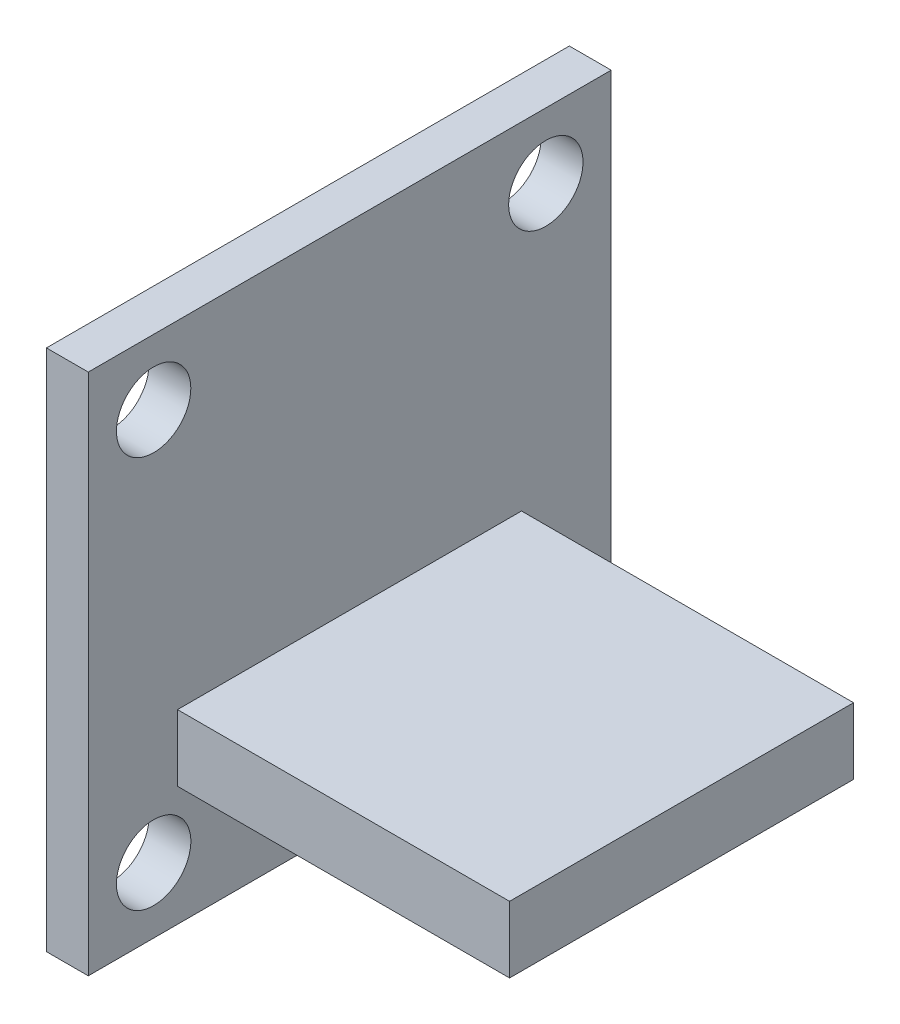
ISO-10303-21;
HEADER;
FILE_DESCRIPTION(('STEP AP214'),'2;1');
FILE_NAME('part.step','',(''),(''),'','','');
FILE_SCHEMA(('AUTOMOTIVE_DESIGN { 1 0 10303 214 1 1 1 1 }'));
ENDSEC;
DATA;
#1=APPLICATION_CONTEXT('core data for automotive mechanical design processes');
#2=APPLICATION_PROTOCOL_DEFINITION('international standard','automotive_design',2000,#1);
#3=PRODUCT_CONTEXT('',#1,'mechanical');
#4=PRODUCT('Part','Part','',(#3));
#5=PRODUCT_RELATED_PRODUCT_CATEGORY('part','',(#4));
#6=PRODUCT_DEFINITION_FORMATION('','',#4);
#7=PRODUCT_DEFINITION_CONTEXT('part definition',#1,'design');
#8=PRODUCT_DEFINITION('design','',#6,#7);
#9=PRODUCT_DEFINITION_SHAPE('','',#8);
#10=(LENGTH_UNIT() NAMED_UNIT(*) SI_UNIT(.MILLI.,.METRE.));
#11=(NAMED_UNIT(*) PLANE_ANGLE_UNIT() SI_UNIT($,.RADIAN.));
#12=(NAMED_UNIT(*) SI_UNIT($,.STERADIAN.) SOLID_ANGLE_UNIT());
#13=UNCERTAINTY_MEASURE_WITH_UNIT(LENGTH_MEASURE(1.E-05),#10,'distance_accuracy_value','');
#14=(GEOMETRIC_REPRESENTATION_CONTEXT(3) GLOBAL_UNCERTAINTY_ASSIGNED_CONTEXT((#13)) GLOBAL_UNIT_ASSIGNED_CONTEXT((#10,
#11,#12)) REPRESENTATION_CONTEXT('',''));
#15=CARTESIAN_POINT('',(0.,0.,0.));
#16=DIRECTION('',(0.,0.,1.));
#17=DIRECTION('',(1.,0.,0.));
#18=AXIS2_PLACEMENT_3D('',#15,#16,#17);
#19=CARTESIAN_POINT('',(1.6002,20.,0.));
#20=DIRECTION('',(-1.,0.,0.));
#21=DIRECTION('',(0.,0.,1.));
#22=AXIS2_PLACEMENT_3D('',#19,#20,#21);
#23=PLANE('',#22);
#24=DIRECTION('',(0.,-1.,0.));
#25=VECTOR('',#24,1.);
#26=CARTESIAN_POINT('',(1.6002,0.,0.));
#27=LINE('',#26,#25);
#28=CARTESIAN_POINT('',(1.6002,20.,0.));
#29=VERTEX_POINT('',#28);
#30=CARTESIAN_POINT('',(1.6002,0.,0.));
#31=VERTEX_POINT('',#30);
#32=EDGE_CURVE('E157',#29,#31,#27,.T.);
#33=ORIENTED_EDGE('',*,*,#32,.T.);
#34=DIRECTION('',(0.,0.,-1.));
#35=VECTOR('',#34,1.);
#36=CARTESIAN_POINT('',(1.6002,0.,0.));
#37=LINE('',#36,#35);
#38=CARTESIAN_POINT('',(1.6002,0.,-20.));
#39=VERTEX_POINT('',#38);
#40=EDGE_CURVE('E160',#31,#39,#37,.T.);
#41=ORIENTED_EDGE('',*,*,#40,.T.);
#42=DIRECTION('',(0.,1.,0.));
#43=VECTOR('',#42,1.);
#44=CARTESIAN_POINT('',(1.6002,0.,-20.));
#45=LINE('',#44,#43);
#46=CARTESIAN_POINT('',(1.6002,20.,-20.));
#47=VERTEX_POINT('',#46);
#48=EDGE_CURVE('E162',#39,#47,#45,.T.);
#49=ORIENTED_EDGE('',*,*,#48,.T.);
#50=DIRECTION('',(0.,0.,1.));
#51=VECTOR('',#50,1.);
#52=CARTESIAN_POINT('',(1.6002,20.,0.));
#53=LINE('',#52,#51);
#54=EDGE_CURVE('E164',#47,#29,#53,.T.);
#55=ORIENTED_EDGE('',*,*,#54,.T.);
#56=EDGE_LOOP('',(#33,#41,#49,#55));
#57=FACE_BOUND('',#56,.T.);
#58=CARTESIAN_POINT('',(1.6002,17.5,-2.5));
#59=DIRECTION('',(1.,0.,0.));
#60=DIRECTION('',(0.,0.,-1.));
#61=AXIS2_PLACEMENT_3D('',#58,#59,#60);
#62=CIRCLE('',#61,1.4224);
#63=CARTESIAN_POINT('',(1.6002,17.5,-3.9224));
#64=VERTEX_POINT('',#63);
#65=EDGE_CURVE('E142',#64,#64,#62,.T.);
#66=ORIENTED_EDGE('',*,*,#65,.F.);
#67=EDGE_LOOP('',(#66));
#68=FACE_BOUND('',#67,.T.);
#69=CARTESIAN_POINT('',(1.6002,17.5,-17.5));
#70=DIRECTION('',(1.,0.,0.));
#71=DIRECTION('',(0.,0.,1.));
#72=AXIS2_PLACEMENT_3D('',#69,#70,#71);
#73=CIRCLE('',#72,1.4224);
#74=CARTESIAN_POINT('',(1.6002,17.5,-16.0776));
#75=VERTEX_POINT('',#74);
#76=EDGE_CURVE('E136',#75,#75,#73,.T.);
#77=ORIENTED_EDGE('',*,*,#76,.F.);
#78=EDGE_LOOP('',(#77));
#79=FACE_BOUND('',#78,.T.);
#80=CARTESIAN_POINT('',(1.6002,2.5,-17.5));
#81=DIRECTION('',(1.,0.,0.));
#82=DIRECTION('',(0.,0.,-1.));
#83=AXIS2_PLACEMENT_3D('',#80,#81,#82);
#84=CIRCLE('',#83,1.4224);
#85=CARTESIAN_POINT('',(1.6002,2.5,-18.9224));
#86=VERTEX_POINT('',#85);
#87=EDGE_CURVE('E130',#86,#86,#84,.T.);
#88=ORIENTED_EDGE('',*,*,#87,.F.);
#89=EDGE_LOOP('',(#88));
#90=FACE_BOUND('',#89,.T.);
#91=CARTESIAN_POINT('',(1.6002,2.5,-2.5));
#92=DIRECTION('',(1.,0.,0.));
#93=DIRECTION('',(0.,0.,1.));
#94=AXIS2_PLACEMENT_3D('',#91,#92,#93);
#95=CIRCLE('',#94,1.4224);
#96=CARTESIAN_POINT('',(1.6002,2.5,-1.0776));
#97=VERTEX_POINT('',#96);
#98=EDGE_CURVE('E124',#97,#97,#95,.T.);
#99=ORIENTED_EDGE('',*,*,#98,.F.);
#100=EDGE_LOOP('',(#99));
#101=FACE_BOUND('',#100,.T.);
#102=DIRECTION('',(0.,-1.,0.));
#103=VECTOR('',#102,1.);
#104=CARTESIAN_POINT('',(1.6002,7.112,-3.4138));
#105=LINE('',#104,#103);
#106=CARTESIAN_POINT('',(1.6002,7.112,-3.4138));
#107=VERTEX_POINT('',#106);
#108=CARTESIAN_POINT('',(1.6002,4.572,-3.4138));
#109=VERTEX_POINT('',#108);
#110=EDGE_CURVE('E92',#107,#109,#105,.T.);
#111=ORIENTED_EDGE('',*,*,#110,.F.);
#112=DIRECTION('',(0.,0.,1.));
#113=VECTOR('',#112,1.);
#114=CARTESIAN_POINT('',(1.6002,7.112,-3.4138));
#115=LINE('',#114,#113);
#116=CARTESIAN_POINT('',(1.6002,7.112,-16.571));
#117=VERTEX_POINT('',#116);
#118=EDGE_CURVE('E94',#117,#107,#115,.T.);
#119=ORIENTED_EDGE('',*,*,#118,.F.);
#120=DIRECTION('',(0.,1.,0.));
#121=VECTOR('',#120,1.);
#122=CARTESIAN_POINT('',(1.6002,7.112,-16.571));
#123=LINE('',#122,#121);
#124=CARTESIAN_POINT('',(1.6002,4.572,-16.571));
#125=VERTEX_POINT('',#124);
#126=EDGE_CURVE('E51',#125,#117,#123,.T.);
#127=ORIENTED_EDGE('',*,*,#126,.F.);
#128=DIRECTION('',(0.,0.,-1.));
#129=VECTOR('',#128,1.);
#130=CARTESIAN_POINT('',(1.6002,4.572,-3.4138));
#131=LINE('',#130,#129);
#132=EDGE_CURVE('E46',#109,#125,#131,.T.);
#133=ORIENTED_EDGE('',*,*,#132,.F.);
#134=EDGE_LOOP('',(#111,#119,#127,#133));
#135=FACE_BOUND('',#134,.T.);
#136=ADVANCED_FACE('F31',(#57,#68,#79,#90,#101,#135),#23,.F.);
#137=CARTESIAN_POINT('',(1.6002,0.,0.));
#138=DIRECTION('',(0.,0.,-1.));
#139=DIRECTION('',(-1.,0.,0.));
#140=AXIS2_PLACEMENT_3D('',#137,#138,#139);
#141=PLANE('',#140);
#142=DIRECTION('',(0.,-1.,0.));
#143=VECTOR('',#142,1.);
#144=CARTESIAN_POINT('',(0.,0.,0.));
#145=LINE('',#144,#143);
#146=CARTESIAN_POINT('',(0.,20.,0.));
#147=VERTEX_POINT('',#146);
#148=CARTESIAN_POINT('',(0.,0.,0.));
#149=VERTEX_POINT('',#148);
#150=EDGE_CURVE('E148',#147,#149,#145,.T.);
#151=ORIENTED_EDGE('',*,*,#150,.T.);
#152=DIRECTION('',(-1.,0.,0.));
#153=VECTOR('',#152,1.);
#154=CARTESIAN_POINT('',(1.6002,0.,0.));
#155=LINE('',#154,#153);
#156=EDGE_CURVE('E11',#31,#149,#155,.T.);
#157=ORIENTED_EDGE('',*,*,#156,.F.);
#158=ORIENTED_EDGE('',*,*,#32,.F.);
#159=DIRECTION('',(-1.,0.,0.));
#160=VECTOR('',#159,1.);
#161=CARTESIAN_POINT('',(1.6002,20.,0.));
#162=LINE('',#161,#160);
#163=EDGE_CURVE('E166',#29,#147,#162,.T.);
#164=ORIENTED_EDGE('',*,*,#163,.T.);
#165=EDGE_LOOP('',(#151,#157,#158,#164));
#166=FACE_BOUND('',#165,.T.);
#167=ADVANCED_FACE('F33',(#166),#141,.F.);
#168=CARTESIAN_POINT('',(1.6002,0.,0.));
#169=DIRECTION('',(0.,1.,0.));
#170=DIRECTION('',(0.,0.,1.));
#171=AXIS2_PLACEMENT_3D('',#168,#169,#170);
#172=PLANE('',#171);
#173=DIRECTION('',(0.,0.,-1.));
#174=VECTOR('',#173,1.);
#175=CARTESIAN_POINT('',(0.,0.,0.));
#176=LINE('',#175,#174);
#177=CARTESIAN_POINT('',(0.,0.,-20.));
#178=VERTEX_POINT('',#177);
#179=EDGE_CURVE('E151',#149,#178,#176,.T.);
#180=ORIENTED_EDGE('',*,*,#179,.T.);
#181=DIRECTION('',(-1.,0.,0.));
#182=VECTOR('',#181,1.);
#183=CARTESIAN_POINT('',(1.6002,0.,-20.));
#184=LINE('',#183,#182);
#185=EDGE_CURVE('E39',#39,#178,#184,.T.);
#186=ORIENTED_EDGE('',*,*,#185,.F.);
#187=ORIENTED_EDGE('',*,*,#40,.F.);
#188=ORIENTED_EDGE('',*,*,#156,.T.);
#189=EDGE_LOOP('',(#180,#186,#187,#188));
#190=FACE_BOUND('',#189,.T.);
#191=ADVANCED_FACE('F192',(#190),#172,.F.);
#192=CARTESIAN_POINT('',(1.6002,0.,-20.));
#193=DIRECTION('',(0.,0.,1.));
#194=DIRECTION('',(1.,0.,0.));
#195=AXIS2_PLACEMENT_3D('',#192,#193,#194);
#196=PLANE('',#195);
#197=DIRECTION('',(0.,1.,0.));
#198=VECTOR('',#197,1.);
#199=CARTESIAN_POINT('',(0.,0.,-20.));
#200=LINE('',#199,#198);
#201=CARTESIAN_POINT('',(0.,20.,-20.));
#202=VERTEX_POINT('',#201);
#203=EDGE_CURVE('E153',#178,#202,#200,.T.);
#204=ORIENTED_EDGE('',*,*,#203,.T.);
#205=DIRECTION('',(-1.,0.,0.));
#206=VECTOR('',#205,1.);
#207=CARTESIAN_POINT('',(1.6002,20.,-20.));
#208=LINE('',#207,#206);
#209=EDGE_CURVE('E169',#47,#202,#208,.T.);
#210=ORIENTED_EDGE('',*,*,#209,.F.);
#211=ORIENTED_EDGE('',*,*,#48,.F.);
#212=ORIENTED_EDGE('',*,*,#185,.T.);
#213=EDGE_LOOP('',(#204,#210,#211,#212));
#214=FACE_BOUND('',#213,.T.);
#215=ADVANCED_FACE('F176',(#214),#196,.F.);
#216=CARTESIAN_POINT('',(1.6002,20.,0.));
#217=DIRECTION('',(0.,-1.,0.));
#218=DIRECTION('',(0.,0.,-1.));
#219=AXIS2_PLACEMENT_3D('',#216,#217,#218);
#220=PLANE('',#219);
#221=DIRECTION('',(0.,0.,1.));
#222=VECTOR('',#221,1.);
#223=CARTESIAN_POINT('',(0.,20.,0.));
#224=LINE('',#223,#222);
#225=EDGE_CURVE('E155',#202,#147,#224,.T.);
#226=ORIENTED_EDGE('',*,*,#225,.T.);
#227=ORIENTED_EDGE('',*,*,#163,.F.);
#228=ORIENTED_EDGE('',*,*,#54,.F.);
#229=ORIENTED_EDGE('',*,*,#209,.T.);
#230=EDGE_LOOP('',(#226,#227,#228,#229));
#231=FACE_BOUND('',#230,.T.);
#232=ADVANCED_FACE('F185',(#231),#220,.F.);
#233=CARTESIAN_POINT('',(0.,20.,0.));
#234=DIRECTION('',(-1.,0.,0.));
#235=DIRECTION('',(0.,0.,1.));
#236=AXIS2_PLACEMENT_3D('',#233,#234,#235);
#237=PLANE('',#236);
#238=CARTESIAN_POINT('',(0.,2.5,-2.5));
#239=DIRECTION('',(1.,0.,0.));
#240=DIRECTION('',(0.,0.,1.));
#241=AXIS2_PLACEMENT_3D('',#238,#239,#240);
#242=CIRCLE('',#241,1.4224);
#243=CARTESIAN_POINT('',(0.,2.5,-1.0776));
#244=VERTEX_POINT('',#243);
#245=EDGE_CURVE('E127',#244,#244,#242,.T.);
#246=ORIENTED_EDGE('',*,*,#245,.T.);
#247=EDGE_LOOP('',(#246));
#248=FACE_BOUND('',#247,.T.);
#249=CARTESIAN_POINT('',(0.,2.5,-17.5));
#250=DIRECTION('',(1.,0.,0.));
#251=DIRECTION('',(0.,0.,-1.));
#252=AXIS2_PLACEMENT_3D('',#249,#250,#251);
#253=CIRCLE('',#252,1.4224);
#254=CARTESIAN_POINT('',(0.,2.5,-18.9224));
#255=VERTEX_POINT('',#254);
#256=EDGE_CURVE('E133',#255,#255,#253,.T.);
#257=ORIENTED_EDGE('',*,*,#256,.T.);
#258=EDGE_LOOP('',(#257));
#259=FACE_BOUND('',#258,.T.);
#260=CARTESIAN_POINT('',(0.,17.5,-17.5));
#261=DIRECTION('',(1.,0.,0.));
#262=DIRECTION('',(0.,0.,1.));
#263=AXIS2_PLACEMENT_3D('',#260,#261,#262);
#264=CIRCLE('',#263,1.4224);
#265=CARTESIAN_POINT('',(0.,17.5,-16.0776));
#266=VERTEX_POINT('',#265);
#267=EDGE_CURVE('E139',#266,#266,#264,.T.);
#268=ORIENTED_EDGE('',*,*,#267,.T.);
#269=EDGE_LOOP('',(#268));
#270=FACE_BOUND('',#269,.T.);
#271=CARTESIAN_POINT('',(0.,17.5,-2.5));
#272=DIRECTION('',(1.,0.,0.));
#273=DIRECTION('',(0.,0.,-1.));
#274=AXIS2_PLACEMENT_3D('',#271,#272,#273);
#275=CIRCLE('',#274,1.4224);
#276=CARTESIAN_POINT('',(0.,17.5,-3.9224));
#277=VERTEX_POINT('',#276);
#278=EDGE_CURVE('E145',#277,#277,#275,.T.);
#279=ORIENTED_EDGE('',*,*,#278,.T.);
#280=EDGE_LOOP('',(#279));
#281=FACE_BOUND('',#280,.T.);
#282=ORIENTED_EDGE('',*,*,#150,.F.);
#283=ORIENTED_EDGE('',*,*,#225,.F.);
#284=ORIENTED_EDGE('',*,*,#203,.F.);
#285=ORIENTED_EDGE('',*,*,#179,.F.);
#286=EDGE_LOOP('',(#282,#283,#284,#285));
#287=FACE_BOUND('',#286,.T.);
#288=ADVANCED_FACE('F182',(#248,#259,#270,#281,#287),#237,.T.);
#289=CARTESIAN_POINT('',(0.,17.5,-2.5));
#290=DIRECTION('',(1.,0.,0.));
#291=DIRECTION('',(0.,0.,-1.));
#292=AXIS2_PLACEMENT_3D('',#289,#290,#291);
#293=CYLINDRICAL_SURFACE('',#292,1.4224);
#294=ORIENTED_EDGE('',*,*,#278,.F.);
#295=EDGE_LOOP('',(#294));
#296=FACE_BOUND('',#295,.T.);
#297=ORIENTED_EDGE('',*,*,#65,.T.);
#298=EDGE_LOOP('',(#297));
#299=FACE_BOUND('',#298,.T.);
#300=ADVANCED_FACE('F210',(#296,#299),#293,.F.);
#301=CARTESIAN_POINT('',(0.,17.5,-17.5));
#302=DIRECTION('',(1.,0.,0.));
#303=DIRECTION('',(0.,0.,-1.));
#304=AXIS2_PLACEMENT_3D('',#301,#302,#303);
#305=CYLINDRICAL_SURFACE('',#304,1.4224);
#306=ORIENTED_EDGE('',*,*,#267,.F.);
#307=EDGE_LOOP('',(#306));
#308=FACE_BOUND('',#307,.T.);
#309=ORIENTED_EDGE('',*,*,#76,.T.);
#310=EDGE_LOOP('',(#309));
#311=FACE_BOUND('',#310,.T.);
#312=ADVANCED_FACE('F215',(#308,#311),#305,.F.);
#313=CARTESIAN_POINT('',(0.,2.5,-17.5));
#314=DIRECTION('',(1.,0.,0.));
#315=DIRECTION('',(0.,0.,-1.));
#316=AXIS2_PLACEMENT_3D('',#313,#314,#315);
#317=CYLINDRICAL_SURFACE('',#316,1.4224);
#318=ORIENTED_EDGE('',*,*,#256,.F.);
#319=EDGE_LOOP('',(#318));
#320=FACE_BOUND('',#319,.T.);
#321=ORIENTED_EDGE('',*,*,#87,.T.);
#322=EDGE_LOOP('',(#321));
#323=FACE_BOUND('',#322,.T.);
#324=ADVANCED_FACE('F235',(#320,#323),#317,.F.);
#325=CARTESIAN_POINT('',(0.,2.5,-2.5));
#326=DIRECTION('',(1.,0.,0.));
#327=DIRECTION('',(0.,0.,-1.));
#328=AXIS2_PLACEMENT_3D('',#325,#326,#327);
#329=CYLINDRICAL_SURFACE('',#328,1.4224);
#330=ORIENTED_EDGE('',*,*,#245,.F.);
#331=EDGE_LOOP('',(#330));
#332=FACE_BOUND('',#331,.T.);
#333=ORIENTED_EDGE('',*,*,#98,.T.);
#334=EDGE_LOOP('',(#333));
#335=FACE_BOUND('',#334,.T.);
#336=ADVANCED_FACE('F233',(#332,#335),#329,.F.);
#337=CARTESIAN_POINT('',(14.3002,7.112,-3.4138));
#338=DIRECTION('',(0.,0.,-1.));
#339=DIRECTION('',(0.,1.,0.));
#340=AXIS2_PLACEMENT_3D('',#337,#338,#339);
#341=PLANE('',#340);
#342=ORIENTED_EDGE('',*,*,#110,.T.);
#343=DIRECTION('',(-1.,0.,0.));
#344=VECTOR('',#343,1.);
#345=CARTESIAN_POINT('',(14.3002,4.572,-3.4138));
#346=LINE('',#345,#344);
#347=CARTESIAN_POINT('',(14.3002,4.572,-3.4138));
#348=VERTEX_POINT('',#347);
#349=EDGE_CURVE('E122',#348,#109,#346,.T.);
#350=ORIENTED_EDGE('',*,*,#349,.F.);
#351=DIRECTION('',(0.,-1.,0.));
#352=VECTOR('',#351,1.);
#353=CARTESIAN_POINT('',(14.3002,7.112,-3.4138));
#354=LINE('',#353,#352);
#355=CARTESIAN_POINT('',(14.3002,7.112,-3.4138));
#356=VERTEX_POINT('',#355);
#357=EDGE_CURVE('E108',#356,#348,#354,.T.);
#358=ORIENTED_EDGE('',*,*,#357,.F.);
#359=DIRECTION('',(-1.,0.,0.));
#360=VECTOR('',#359,1.);
#361=CARTESIAN_POINT('',(14.3002,7.112,-3.4138));
#362=LINE('',#361,#360);
#363=EDGE_CURVE('E104',#356,#107,#362,.T.);
#364=ORIENTED_EDGE('',*,*,#363,.T.);
#365=EDGE_LOOP('',(#342,#350,#358,#364));
#366=FACE_BOUND('',#365,.T.);
#367=ADVANCED_FACE('F110',(#366),#341,.F.);
#368=CARTESIAN_POINT('',(14.3002,4.572,-3.4138));
#369=DIRECTION('',(0.,1.,0.));
#370=DIRECTION('',(0.,0.,1.));
#371=AXIS2_PLACEMENT_3D('',#368,#369,#370);
#372=PLANE('',#371);
#373=ORIENTED_EDGE('',*,*,#132,.T.);
#374=DIRECTION('',(-1.,0.,0.));
#375=VECTOR('',#374,1.);
#376=CARTESIAN_POINT('',(14.3002,4.572,-16.571));
#377=LINE('',#376,#375);
#378=CARTESIAN_POINT('',(14.3002,4.572,-16.571));
#379=VERTEX_POINT('',#378);
#380=EDGE_CURVE('E114',#379,#125,#377,.T.);
#381=ORIENTED_EDGE('',*,*,#380,.F.);
#382=DIRECTION('',(0.,0.,-1.));
#383=VECTOR('',#382,1.);
#384=CARTESIAN_POINT('',(14.3002,4.572,-3.4138));
#385=LINE('',#384,#383);
#386=EDGE_CURVE('E313',#348,#379,#385,.T.);
#387=ORIENTED_EDGE('',*,*,#386,.F.);
#388=ORIENTED_EDGE('',*,*,#349,.T.);
#389=EDGE_LOOP('',(#373,#381,#387,#388));
#390=FACE_BOUND('',#389,.T.);
#391=ADVANCED_FACE('F242',(#390),#372,.F.);
#392=CARTESIAN_POINT('',(14.3002,7.112,-16.571));
#393=DIRECTION('',(0.,0.,1.));
#394=DIRECTION('',(0.,-1.,0.));
#395=AXIS2_PLACEMENT_3D('',#392,#393,#394);
#396=PLANE('',#395);
#397=ORIENTED_EDGE('',*,*,#126,.T.);
#398=DIRECTION('',(-1.,0.,0.));
#399=VECTOR('',#398,1.);
#400=CARTESIAN_POINT('',(14.3002,7.112,-16.571));
#401=LINE('',#400,#399);
#402=CARTESIAN_POINT('',(14.3002,7.112,-16.571));
#403=VERTEX_POINT('',#402);
#404=EDGE_CURVE('E107',#403,#117,#401,.T.);
#405=ORIENTED_EDGE('',*,*,#404,.F.);
#406=DIRECTION('',(0.,1.,0.));
#407=VECTOR('',#406,1.);
#408=CARTESIAN_POINT('',(14.3002,7.112,-16.571));
#409=LINE('',#408,#407);
#410=EDGE_CURVE('E116',#379,#403,#409,.T.);
#411=ORIENTED_EDGE('',*,*,#410,.F.);
#412=ORIENTED_EDGE('',*,*,#380,.T.);
#413=EDGE_LOOP('',(#397,#405,#411,#412));
#414=FACE_BOUND('',#413,.T.);
#415=ADVANCED_FACE('F282',(#414),#396,.F.);
#416=CARTESIAN_POINT('',(14.3002,7.112,-3.4138));
#417=DIRECTION('',(0.,-1.,0.));
#418=DIRECTION('',(0.,0.,-1.));
#419=AXIS2_PLACEMENT_3D('',#416,#417,#418);
#420=PLANE('',#419);
#421=ORIENTED_EDGE('',*,*,#118,.T.);
#422=ORIENTED_EDGE('',*,*,#363,.F.);
#423=DIRECTION('',(0.,0.,1.));
#424=VECTOR('',#423,1.);
#425=CARTESIAN_POINT('',(14.3002,7.112,-3.4138));
#426=LINE('',#425,#424);
#427=EDGE_CURVE('E112',#403,#356,#426,.T.);
#428=ORIENTED_EDGE('',*,*,#427,.F.);
#429=ORIENTED_EDGE('',*,*,#404,.T.);
#430=EDGE_LOOP('',(#421,#422,#428,#429));
#431=FACE_BOUND('',#430,.T.);
#432=ADVANCED_FACE('F102',(#431),#420,.F.);
#433=CARTESIAN_POINT('',(14.3002,4.572,-3.4138));
#434=DIRECTION('',(1.,0.,0.));
#435=DIRECTION('',(0.,0.,-1.));
#436=AXIS2_PLACEMENT_3D('',#433,#434,#435);
#437=PLANE('',#436);
#438=ORIENTED_EDGE('',*,*,#357,.T.);
#439=ORIENTED_EDGE('',*,*,#386,.T.);
#440=ORIENTED_EDGE('',*,*,#410,.T.);
#441=ORIENTED_EDGE('',*,*,#427,.T.);
#442=EDGE_LOOP('',(#438,#439,#440,#441));
#443=FACE_BOUND('',#442,.T.);
#444=ADVANCED_FACE('F300',(#443),#437,.T.);
#445=CLOSED_SHELL('',(#136,#167,#191,#215,#232,#288,#300,#312,#324,#336,#367,#391,#415,#432,#444));
#446=MANIFOLD_SOLID_BREP('B2',#445);
#447=ADVANCED_BREP_SHAPE_REPRESENTATION('',(#18,#446),#14);
#448=SHAPE_DEFINITION_REPRESENTATION(#9,#447);
ENDSEC;
END-ISO-10303-21;
